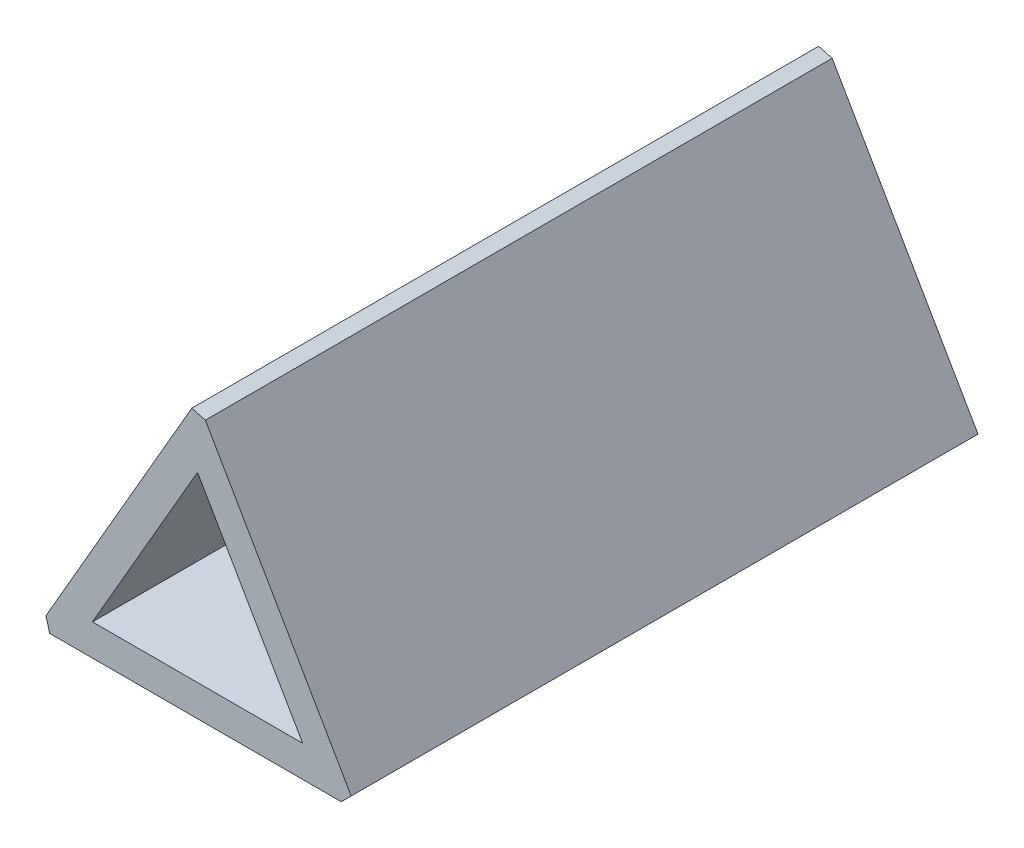
ISO-10303-21;
HEADER;
FILE_DESCRIPTION(('STEP AP214'),'2;1');
FILE_NAME('part.step','',(''),(''),'','','');
FILE_SCHEMA(('AUTOMOTIVE_DESIGN { 1 0 10303 214 1 1 1 1 }'));
ENDSEC;
DATA;
#1=APPLICATION_CONTEXT('core data for automotive mechanical design processes');
#2=APPLICATION_PROTOCOL_DEFINITION('international standard','automotive_design',2000,#1);
#3=PRODUCT_CONTEXT('',#1,'mechanical');
#4=PRODUCT('Part','Part','',(#3));
#5=PRODUCT_RELATED_PRODUCT_CATEGORY('part','',(#4));
#6=PRODUCT_DEFINITION_FORMATION('','',#4);
#7=PRODUCT_DEFINITION_CONTEXT('part definition',#1,'design');
#8=PRODUCT_DEFINITION('design','',#6,#7);
#9=PRODUCT_DEFINITION_SHAPE('','',#8);
#10=(LENGTH_UNIT() NAMED_UNIT(*) SI_UNIT(.MILLI.,.METRE.));
#11=(NAMED_UNIT(*) PLANE_ANGLE_UNIT() SI_UNIT($,.RADIAN.));
#12=(NAMED_UNIT(*) SI_UNIT($,.STERADIAN.) SOLID_ANGLE_UNIT());
#13=UNCERTAINTY_MEASURE_WITH_UNIT(LENGTH_MEASURE(1.E-05),#10,'distance_accuracy_value','');
#14=(GEOMETRIC_REPRESENTATION_CONTEXT(3) GLOBAL_UNCERTAINTY_ASSIGNED_CONTEXT((#13)) GLOBAL_UNIT_ASSIGNED_CONTEXT((#10,
#11,#12)) REPRESENTATION_CONTEXT('',''));
#15=CARTESIAN_POINT('',(0.,0.,0.));
#16=DIRECTION('',(0.,0.,1.));
#17=DIRECTION('',(1.,0.,0.));
#18=AXIS2_PLACEMENT_3D('',#15,#16,#17);
#19=CARTESIAN_POINT('',(0.,0.,40.));
#20=DIRECTION('',(0.,0.,1.));
#21=DIRECTION('',(1.,0.,0.));
#22=AXIS2_PLACEMENT_3D('',#19,#20,#21);
#23=PLANE('',#22);
#24=DIRECTION('',(-0.5,-0.866025403784439,0.));
#25=VECTOR('',#24,1.);
#26=CARTESIAN_POINT('',(0.,11.7450815951457,40.));
#27=LINE('',#26,#25);
#28=CARTESIAN_POINT('',(-0.366025403784441,11.1111069989302,40.));
#29=VERTEX_POINT('',#28);
#30=CARTESIAN_POINT('',(-9.67153903091725,-5.00651539378842,40.));
#31=VERTEX_POINT('',#30);
#32=EDGE_CURVE('E140',#29,#31,#27,.T.);
#33=ORIENTED_EDGE('',*,*,#32,.T.);
#34=DIRECTION('',(-0.258819045102522,0.965925826289068,0.));
#35=VECTOR('',#34,1.);
#36=CARTESIAN_POINT('',(-10.2752976111393,-2.75325769689422,40.));
#37=LINE('',#36,#35);
#38=CARTESIAN_POINT('',(-9.43948822334837,-5.87254079757287,40.));
#39=VERTEX_POINT('',#38);
#40=EDGE_CURVE('E171',#31,#39,#37,.F.);
#41=ORIENTED_EDGE('',*,*,#40,.T.);
#42=DIRECTION('',(1.,0.,0.));
#43=VECTOR('',#42,1.);
#44=CARTESIAN_POINT('',(-10.1715390309173,-5.87254079757287,40.));
#45=LINE('',#44,#43);
#46=CARTESIAN_POINT('',(9.17153903091723,-5.87254079757286,40.));
#47=VERTEX_POINT('',#46);
#48=EDGE_CURVE('E144',#39,#47,#45,.T.);
#49=ORIENTED_EDGE('',*,*,#48,.T.);
#50=DIRECTION('',(-0.707106781186548,-0.707106781186547,0.));
#51=VECTOR('',#50,1.);
#52=CARTESIAN_POINT('',(7.52203991424503,-7.52203991424505,40.));
#53=LINE('',#52,#51);
#54=CARTESIAN_POINT('',(9.80551362713281,-5.23856620135728,40.));
#55=VERTEX_POINT('',#54);
#56=EDGE_CURVE('E54',#47,#55,#53,.F.);
#57=ORIENTED_EDGE('',*,*,#56,.T.);
#58=DIRECTION('',(-0.5,0.866025403784439,0.));
#59=VECTOR('',#58,1.);
#60=CARTESIAN_POINT('',(10.1715390309173,-5.87254079757286,40.));
#61=LINE('',#60,#59);
#62=CARTESIAN_POINT('',(0.500000000000009,10.8790561913613,40.));
#63=VERTEX_POINT('',#62);
#64=EDGE_CURVE('E138',#55,#63,#61,.T.);
#65=ORIENTED_EDGE('',*,*,#64,.T.);
#66=DIRECTION('',(0.965925826289069,-0.258819045102519,0.));
#67=VECTOR('',#66,1.);
#68=CARTESIAN_POINT('',(2.7532576968942,10.2752976111393,40.));
#69=LINE('',#68,#67);
#70=EDGE_CURVE('E168',#63,#29,#69,.F.);
#71=ORIENTED_EDGE('',*,*,#70,.T.);
#72=EDGE_LOOP('',(#33,#41,#49,#57,#65,#71));
#73=FACE_BOUND('',#72,.T.);
#74=DIRECTION('',(-0.5,-0.866025403784439,0.));
#75=VECTOR('',#74,1.);
#76=CARTESIAN_POINT('',(0.,7.74508159514573,40.));
#77=LINE('',#76,#75);
#78=CARTESIAN_POINT('',(0.,7.74508159514573,40.));
#79=VERTEX_POINT('',#78);
#80=CARTESIAN_POINT('',(-6.7074374157795,-3.87254079757287,40.));
#81=VERTEX_POINT('',#80);
#82=EDGE_CURVE('E116',#79,#81,#77,.T.);
#83=ORIENTED_EDGE('',*,*,#82,.F.);
#84=DIRECTION('',(-0.5,0.866025403784439,0.));
#85=VECTOR('',#84,1.);
#86=CARTESIAN_POINT('',(6.70743741577951,-3.87254079757287,40.));
#87=LINE('',#86,#85);
#88=CARTESIAN_POINT('',(6.70743741577951,-3.87254079757287,40.));
#89=VERTEX_POINT('',#88);
#90=EDGE_CURVE('E106',#89,#79,#87,.T.);
#91=ORIENTED_EDGE('',*,*,#90,.F.);
#92=DIRECTION('',(1.,0.,0.));
#93=VECTOR('',#92,1.);
#94=CARTESIAN_POINT('',(-6.7074374157795,-3.87254079757287,40.));
#95=LINE('',#94,#93);
#96=EDGE_CURVE('E127',#81,#89,#95,.T.);
#97=ORIENTED_EDGE('',*,*,#96,.F.);
#98=EDGE_LOOP('',(#83,#91,#97));
#99=FACE_BOUND('',#98,.T.);
#100=ADVANCED_FACE('F33',(#73,#99),#23,.T.);
#101=CARTESIAN_POINT('',(0.,0.,0.));
#102=DIRECTION('',(0.,0.,1.));
#103=DIRECTION('',(1.,0.,0.));
#104=AXIS2_PLACEMENT_3D('',#101,#102,#103);
#105=PLANE('',#104);
#106=DIRECTION('',(1.,0.,0.));
#107=VECTOR('',#106,1.);
#108=CARTESIAN_POINT('',(-10.1715390309173,-5.87254079757287,0.));
#109=LINE('',#108,#107);
#110=CARTESIAN_POINT('',(-9.43948822334837,-5.87254079757287,0.));
#111=VERTEX_POINT('',#110);
#112=CARTESIAN_POINT('',(9.17153903091723,-5.87254079757286,0.));
#113=VERTEX_POINT('',#112);
#114=EDGE_CURVE('E141',#111,#113,#109,.T.);
#115=ORIENTED_EDGE('',*,*,#114,.F.);
#116=DIRECTION('',(0.258819045102522,-0.965925826289068,0.));
#117=VECTOR('',#116,1.);
#118=CARTESIAN_POINT('',(-9.43948822334837,-5.87254079757287,0.));
#119=LINE('',#118,#117);
#120=CARTESIAN_POINT('',(-9.67153903091725,-5.00651539378842,0.));
#121=VERTEX_POINT('',#120);
#122=EDGE_CURVE('E161',#111,#121,#119,.F.);
#123=ORIENTED_EDGE('',*,*,#122,.T.);
#124=DIRECTION('',(-0.5,-0.866025403784439,0.));
#125=VECTOR('',#124,1.);
#126=CARTESIAN_POINT('',(0.,11.7450815951457,0.));
#127=LINE('',#126,#125);
#128=CARTESIAN_POINT('',(-0.366025403784441,11.1111069989302,0.));
#129=VERTEX_POINT('',#128);
#130=EDGE_CURVE('E148',#129,#121,#127,.T.);
#131=ORIENTED_EDGE('',*,*,#130,.F.);
#132=DIRECTION('',(-0.965925826289069,0.258819045102519,0.));
#133=VECTOR('',#132,1.);
#134=CARTESIAN_POINT('',(-0.366025403784441,11.1111069989302,0.));
#135=LINE('',#134,#133);
#136=CARTESIAN_POINT('',(0.500000000000009,10.8790561913613,0.));
#137=VERTEX_POINT('',#136);
#138=EDGE_CURVE('E157',#129,#137,#135,.F.);
#139=ORIENTED_EDGE('',*,*,#138,.T.);
#140=DIRECTION('',(-0.5,0.866025403784439,0.));
#141=VECTOR('',#140,1.);
#142=CARTESIAN_POINT('',(10.1715390309173,-5.87254079757286,0.));
#143=LINE('',#142,#141);
#144=CARTESIAN_POINT('',(9.80551362713281,-5.23856620135728,0.));
#145=VERTEX_POINT('',#144);
#146=EDGE_CURVE('E124',#145,#137,#143,.T.);
#147=ORIENTED_EDGE('',*,*,#146,.F.);
#148=DIRECTION('',(0.707106781186548,0.707106781186547,0.));
#149=VECTOR('',#148,1.);
#150=CARTESIAN_POINT('',(9.80551362713281,-5.23856620135728,0.));
#151=LINE('',#150,#149);
#152=EDGE_CURVE('E159',#145,#113,#151,.F.);
#153=ORIENTED_EDGE('',*,*,#152,.T.);
#154=EDGE_LOOP('',(#115,#123,#131,#139,#147,#153));
#155=FACE_BOUND('',#154,.T.);
#156=DIRECTION('',(-0.5,0.866025403784439,0.));
#157=VECTOR('',#156,1.);
#158=CARTESIAN_POINT('',(6.70743741577951,-3.87254079757287,0.));
#159=LINE('',#158,#157);
#160=CARTESIAN_POINT('',(6.70743741577951,-3.87254079757287,0.));
#161=VERTEX_POINT('',#160);
#162=CARTESIAN_POINT('',(0.,7.74508159514573,0.));
#163=VERTEX_POINT('',#162);
#164=EDGE_CURVE('E131',#161,#163,#159,.T.);
#165=ORIENTED_EDGE('',*,*,#164,.T.);
#166=DIRECTION('',(-0.5,-0.866025403784439,0.));
#167=VECTOR('',#166,1.);
#168=CARTESIAN_POINT('',(0.,7.74508159514573,0.));
#169=LINE('',#168,#167);
#170=CARTESIAN_POINT('',(-6.7074374157795,-3.87254079757287,0.));
#171=VERTEX_POINT('',#170);
#172=EDGE_CURVE('E123',#163,#171,#169,.T.);
#173=ORIENTED_EDGE('',*,*,#172,.T.);
#174=DIRECTION('',(1.,0.,0.));
#175=VECTOR('',#174,1.);
#176=CARTESIAN_POINT('',(-6.7074374157795,-3.87254079757287,0.));
#177=LINE('',#176,#175);
#178=EDGE_CURVE('E117',#171,#161,#177,.T.);
#179=ORIENTED_EDGE('',*,*,#178,.T.);
#180=EDGE_LOOP('',(#165,#173,#179));
#181=FACE_BOUND('',#180,.T.);
#182=ADVANCED_FACE('F185',(#155,#181),#105,.F.);
#183=CARTESIAN_POINT('',(10.1715390309173,-5.87254079757286,40.));
#184=DIRECTION('',(-0.866025403784439,-0.5,0.));
#185=DIRECTION('',(0.5,-0.866025403784439,0.));
#186=AXIS2_PLACEMENT_3D('',#183,#184,#185);
#187=PLANE('',#186);
#188=ORIENTED_EDGE('',*,*,#64,.F.);
#189=DIRECTION('',(0.,0.,-1.));
#190=VECTOR('',#189,1.);
#191=CARTESIAN_POINT('',(9.80551362713281,-5.23856620135728,40.));
#192=LINE('',#191,#190);
#193=EDGE_CURVE('E11',#55,#145,#192,.T.);
#194=ORIENTED_EDGE('',*,*,#193,.T.);
#195=ORIENTED_EDGE('',*,*,#146,.T.);
#196=DIRECTION('',(0.,0.,1.));
#197=VECTOR('',#196,1.);
#198=CARTESIAN_POINT('',(0.500000000000009,10.8790561913613,40.));
#199=LINE('',#198,#197);
#200=EDGE_CURVE('E41',#137,#63,#199,.T.);
#201=ORIENTED_EDGE('',*,*,#200,.T.);
#202=EDGE_LOOP('',(#188,#194,#195,#201));
#203=FACE_BOUND('',#202,.T.);
#204=ADVANCED_FACE('F193',(#203),#187,.F.);
#205=CARTESIAN_POINT('',(0.,11.7450815951457,40.));
#206=DIRECTION('',(0.866025403784439,-0.5,0.));
#207=DIRECTION('',(0.5,0.866025403784439,0.));
#208=AXIS2_PLACEMENT_3D('',#205,#206,#207);
#209=PLANE('',#208);
#210=ORIENTED_EDGE('',*,*,#130,.T.);
#211=DIRECTION('',(0.,0.,1.));
#212=VECTOR('',#211,1.);
#213=CARTESIAN_POINT('',(-9.67153903091725,-5.00651539378842,40.));
#214=LINE('',#213,#212);
#215=EDGE_CURVE('E166',#121,#31,#214,.T.);
#216=ORIENTED_EDGE('',*,*,#215,.T.);
#217=ORIENTED_EDGE('',*,*,#32,.F.);
#218=DIRECTION('',(0.,0.,-1.));
#219=VECTOR('',#218,1.);
#220=CARTESIAN_POINT('',(-0.366025403784441,11.1111069989302,40.));
#221=LINE('',#220,#219);
#222=EDGE_CURVE('E163',#29,#129,#221,.T.);
#223=ORIENTED_EDGE('',*,*,#222,.T.);
#224=EDGE_LOOP('',(#210,#216,#217,#223));
#225=FACE_BOUND('',#224,.T.);
#226=ADVANCED_FACE('F188',(#225),#209,.F.);
#227=CARTESIAN_POINT('',(-10.1715390309173,-5.87254079757287,40.));
#228=DIRECTION('',(0.,1.,0.));
#229=DIRECTION('',(-1.,0.,0.));
#230=AXIS2_PLACEMENT_3D('',#227,#228,#229);
#231=PLANE('',#230);
#232=ORIENTED_EDGE('',*,*,#48,.F.);
#233=DIRECTION('',(0.,0.,-1.));
#234=VECTOR('',#233,1.);
#235=CARTESIAN_POINT('',(-9.43948822334837,-5.87254079757287,40.));
#236=LINE('',#235,#234);
#237=EDGE_CURVE('E154',#39,#111,#236,.T.);
#238=ORIENTED_EDGE('',*,*,#237,.T.);
#239=ORIENTED_EDGE('',*,*,#114,.T.);
#240=DIRECTION('',(0.,0.,1.));
#241=VECTOR('',#240,1.);
#242=CARTESIAN_POINT('',(9.17153903091723,-5.87254079757286,40.));
#243=LINE('',#242,#241);
#244=EDGE_CURVE('E146',#113,#47,#243,.T.);
#245=ORIENTED_EDGE('',*,*,#244,.T.);
#246=EDGE_LOOP('',(#232,#238,#239,#245));
#247=FACE_BOUND('',#246,.T.);
#248=ADVANCED_FACE('F179',(#247),#231,.F.);
#249=CARTESIAN_POINT('',(6.70743741577951,-3.87254079757287,40.));
#250=DIRECTION('',(-0.866025403784439,-0.5,0.));
#251=DIRECTION('',(0.5,-0.866025403784439,0.));
#252=AXIS2_PLACEMENT_3D('',#249,#250,#251);
#253=PLANE('',#252);
#254=ORIENTED_EDGE('',*,*,#164,.F.);
#255=DIRECTION('',(0.,0.,-1.));
#256=VECTOR('',#255,1.);
#257=CARTESIAN_POINT('',(6.70743741577951,-3.87254079757287,40.));
#258=LINE('',#257,#256);
#259=EDGE_CURVE('E112',#89,#161,#258,.T.);
#260=ORIENTED_EDGE('',*,*,#259,.F.);
#261=ORIENTED_EDGE('',*,*,#90,.T.);
#262=DIRECTION('',(0.,0.,-1.));
#263=VECTOR('',#262,1.);
#264=CARTESIAN_POINT('',(0.,7.74508159514573,40.));
#265=LINE('',#264,#263);
#266=EDGE_CURVE('E109',#79,#163,#265,.T.);
#267=ORIENTED_EDGE('',*,*,#266,.T.);
#268=EDGE_LOOP('',(#254,#260,#261,#267));
#269=FACE_BOUND('',#268,.T.);
#270=ADVANCED_FACE('F108',(#269),#253,.T.);
#271=CARTESIAN_POINT('',(0.,7.74508159514573,40.));
#272=DIRECTION('',(0.866025403784438,-0.5,0.));
#273=DIRECTION('',(0.5,0.866025403784439,0.));
#274=AXIS2_PLACEMENT_3D('',#271,#272,#273);
#275=PLANE('',#274);
#276=ORIENTED_EDGE('',*,*,#172,.F.);
#277=ORIENTED_EDGE('',*,*,#266,.F.);
#278=ORIENTED_EDGE('',*,*,#82,.T.);
#279=DIRECTION('',(0.,0.,-1.));
#280=VECTOR('',#279,1.);
#281=CARTESIAN_POINT('',(-6.7074374157795,-3.87254079757287,40.));
#282=LINE('',#281,#280);
#283=EDGE_CURVE('E125',#81,#171,#282,.T.);
#284=ORIENTED_EDGE('',*,*,#283,.T.);
#285=EDGE_LOOP('',(#276,#277,#278,#284));
#286=FACE_BOUND('',#285,.T.);
#287=ADVANCED_FACE('F121',(#286),#275,.T.);
#288=CARTESIAN_POINT('',(-6.7074374157795,-3.87254079757287,40.));
#289=DIRECTION('',(0.,1.,0.));
#290=DIRECTION('',(0.,0.,1.));
#291=AXIS2_PLACEMENT_3D('',#288,#289,#290);
#292=PLANE('',#291);
#293=ORIENTED_EDGE('',*,*,#178,.F.);
#294=ORIENTED_EDGE('',*,*,#283,.F.);
#295=ORIENTED_EDGE('',*,*,#96,.T.);
#296=ORIENTED_EDGE('',*,*,#259,.T.);
#297=EDGE_LOOP('',(#293,#294,#295,#296));
#298=FACE_BOUND('',#297,.T.);
#299=ADVANCED_FACE('F202',(#298),#292,.T.);
#300=CARTESIAN_POINT('',(-9.43948822334837,-5.87254079757287,40.));
#301=DIRECTION('',(0.965925826289068,0.258819045102522,0.));
#302=DIRECTION('',(0.,0.,-1.));
#303=AXIS2_PLACEMENT_3D('',#300,#301,#302);
#304=PLANE('',#303);
#305=ORIENTED_EDGE('',*,*,#40,.F.);
#306=ORIENTED_EDGE('',*,*,#215,.F.);
#307=ORIENTED_EDGE('',*,*,#122,.F.);
#308=ORIENTED_EDGE('',*,*,#237,.F.);
#309=EDGE_LOOP('',(#305,#306,#307,#308));
#310=FACE_BOUND('',#309,.T.);
#311=ADVANCED_FACE('F182',(#310),#304,.F.);
#312=CARTESIAN_POINT('',(9.80551362713281,-5.23856620135728,40.));
#313=DIRECTION('',(-0.707106781186547,0.707106781186548,0.));
#314=DIRECTION('',(0.,0.,-1.));
#315=AXIS2_PLACEMENT_3D('',#312,#313,#314);
#316=PLANE('',#315);
#317=ORIENTED_EDGE('',*,*,#56,.F.);
#318=ORIENTED_EDGE('',*,*,#244,.F.);
#319=ORIENTED_EDGE('',*,*,#152,.F.);
#320=ORIENTED_EDGE('',*,*,#193,.F.);
#321=EDGE_LOOP('',(#317,#318,#319,#320));
#322=FACE_BOUND('',#321,.T.);
#323=ADVANCED_FACE('F196',(#322),#316,.F.);
#324=CARTESIAN_POINT('',(-0.366025403784441,11.1111069989302,40.));
#325=DIRECTION('',(-0.258819045102519,-0.965925826289069,0.));
#326=DIRECTION('',(0.,0.,-1.));
#327=AXIS2_PLACEMENT_3D('',#324,#325,#326);
#328=PLANE('',#327);
#329=ORIENTED_EDGE('',*,*,#70,.F.);
#330=ORIENTED_EDGE('',*,*,#200,.F.);
#331=ORIENTED_EDGE('',*,*,#138,.F.);
#332=ORIENTED_EDGE('',*,*,#222,.F.);
#333=EDGE_LOOP('',(#329,#330,#331,#332));
#334=FACE_BOUND('',#333,.T.);
#335=ADVANCED_FACE('F35',(#334),#328,.F.);
#336=CLOSED_SHELL('',(#100,#182,#204,#226,#248,#270,#287,#299,#311,#323,#335));
#337=MANIFOLD_SOLID_BREP('B2',#336);
#338=ADVANCED_BREP_SHAPE_REPRESENTATION('',(#18,#337),#14);
#339=SHAPE_DEFINITION_REPRESENTATION(#9,#338);
ENDSEC;
END-ISO-10303-21;
